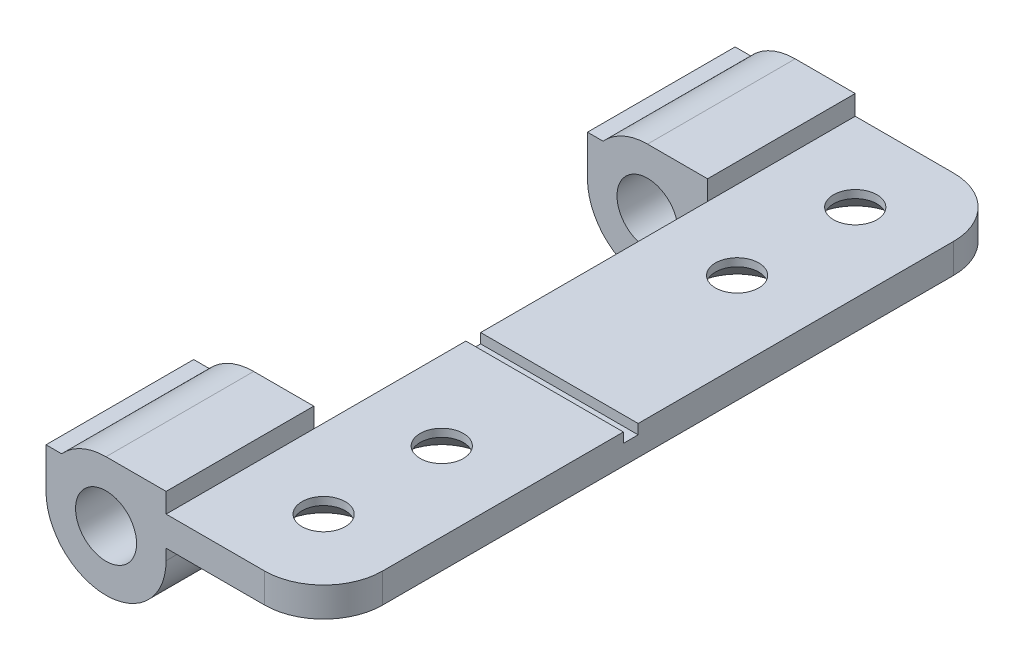
ISO-10303-21;
HEADER;
FILE_DESCRIPTION(('STEP AP214'),'2;1');
FILE_NAME('part.step','',(''),(''),'','','');
FILE_SCHEMA(('AUTOMOTIVE_DESIGN { 1 0 10303 214 1 1 1 1 }'));
ENDSEC;
DATA;
#1=APPLICATION_CONTEXT('core data for automotive mechanical design processes');
#2=APPLICATION_PROTOCOL_DEFINITION('international standard','automotive_design',2000,#1);
#3=PRODUCT_CONTEXT('',#1,'mechanical');
#4=PRODUCT('Part','Part','',(#3));
#5=PRODUCT_RELATED_PRODUCT_CATEGORY('part','',(#4));
#6=PRODUCT_DEFINITION_FORMATION('','',#4);
#7=PRODUCT_DEFINITION_CONTEXT('part definition',#1,'design');
#8=PRODUCT_DEFINITION('design','',#6,#7);
#9=PRODUCT_DEFINITION_SHAPE('','',#8);
#10=(LENGTH_UNIT() NAMED_UNIT(*) SI_UNIT(.MILLI.,.METRE.));
#11=(NAMED_UNIT(*) PLANE_ANGLE_UNIT() SI_UNIT($,.RADIAN.));
#12=(NAMED_UNIT(*) SI_UNIT($,.STERADIAN.) SOLID_ANGLE_UNIT());
#13=UNCERTAINTY_MEASURE_WITH_UNIT(LENGTH_MEASURE(1.E-05),#10,'distance_accuracy_value','');
#14=(GEOMETRIC_REPRESENTATION_CONTEXT(3) GLOBAL_UNCERTAINTY_ASSIGNED_CONTEXT((#13)) GLOBAL_UNIT_ASSIGNED_CONTEXT((#10,
#11,#12)) REPRESENTATION_CONTEXT('',''));
#15=CARTESIAN_POINT('',(0.,0.,0.));
#16=DIRECTION('',(0.,0.,1.));
#17=DIRECTION('',(1.,0.,0.));
#18=AXIS2_PLACEMENT_3D('',#15,#16,#17);
#19=CARTESIAN_POINT('',(3.05,2.05,7.5));
#20=DIRECTION('',(0.,-1.,0.));
#21=DIRECTION('',(0.,0.,-1.));
#22=AXIS2_PLACEMENT_3D('',#19,#20,#21);
#23=PLANE('',#22);
#24=CARTESIAN_POINT('',(7.05,2.05,31.));
#25=DIRECTION('',(0.,-1.,0.));
#26=DIRECTION('',(0.,0.,-1.));
#27=AXIS2_PLACEMENT_3D('',#24,#25,#26);
#28=CIRCLE('',#27,1.1);
#29=CARTESIAN_POINT('',(7.05,2.05,29.9));
#30=VERTEX_POINT('',#29);
#31=EDGE_CURVE('E234',#30,#30,#28,.T.);
#32=ORIENTED_EDGE('',*,*,#31,.T.);
#33=EDGE_LOOP('',(#32));
#34=FACE_BOUND('',#33,.T.);
#35=CARTESIAN_POINT('',(7.05,2.05,25.));
#36=DIRECTION('',(0.,-1.,0.));
#37=DIRECTION('',(0.,0.,-1.));
#38=AXIS2_PLACEMENT_3D('',#35,#36,#37);
#39=CIRCLE('',#38,1.1);
#40=CARTESIAN_POINT('',(7.05,2.05,23.9));
#41=VERTEX_POINT('',#40);
#42=EDGE_CURVE('E395',#41,#41,#39,.T.);
#43=ORIENTED_EDGE('',*,*,#42,.T.);
#44=EDGE_LOOP('',(#43));
#45=FACE_BOUND('',#44,.T.);
#46=DIRECTION('',(-1.,0.,0.));
#47=VECTOR('',#46,1.);
#48=CARTESIAN_POINT('',(11.05,2.05,35.));
#49=LINE('',#48,#47);
#50=CARTESIAN_POINT('',(8.05,2.05,35.));
#51=VERTEX_POINT('',#50);
#52=CARTESIAN_POINT('',(3.05,2.05,35.));
#53=VERTEX_POINT('',#52);
#54=EDGE_CURVE('E255',#51,#53,#49,.T.);
#55=ORIENTED_EDGE('',*,*,#54,.F.);
#56=CARTESIAN_POINT('',(8.05,2.05,32.));
#57=DIRECTION('',(0.,-1.,0.));
#58=DIRECTION('',(0.,0.,-1.));
#59=AXIS2_PLACEMENT_3D('',#56,#57,#58);
#60=CIRCLE('',#59,3.);
#61=CARTESIAN_POINT('',(11.05,2.05,32.));
#62=VERTEX_POINT('',#61);
#63=EDGE_CURVE('E11',#51,#62,#60,.F.);
#64=ORIENTED_EDGE('',*,*,#63,.T.);
#65=DIRECTION('',(0.,0.,-1.));
#66=VECTOR('',#65,1.);
#67=CARTESIAN_POINT('',(11.05,2.05,7.5));
#68=LINE('',#67,#66);
#69=CARTESIAN_POINT('',(11.05,2.05,19.775));
#70=VERTEX_POINT('',#69);
#71=EDGE_CURVE('E202',#62,#70,#68,.T.);
#72=ORIENTED_EDGE('',*,*,#71,.T.);
#73=DIRECTION('',(-1.,0.,0.));
#74=VECTOR('',#73,1.);
#75=CARTESIAN_POINT('',(11.05,2.05,19.775));
#76=LINE('',#75,#74);
#77=CARTESIAN_POINT('',(3.05,2.05,19.775));
#78=VERTEX_POINT('',#77);
#79=EDGE_CURVE('E205',#70,#78,#76,.T.);
#80=ORIENTED_EDGE('',*,*,#79,.T.);
#81=DIRECTION('',(0.,0.,-1.));
#82=VECTOR('',#81,1.);
#83=CARTESIAN_POINT('',(3.05,2.05,27.5));
#84=LINE('',#83,#82);
#85=CARTESIAN_POINT('',(3.05,2.05,27.5));
#86=VERTEX_POINT('',#85);
#87=EDGE_CURVE('E319',#86,#78,#84,.T.);
#88=ORIENTED_EDGE('',*,*,#87,.F.);
#89=DIRECTION('',(0.,0.,-1.));
#90=VECTOR('',#89,1.);
#91=CARTESIAN_POINT('',(3.05,2.05,35.));
#92=LINE('',#91,#90);
#93=EDGE_CURVE('E306',#53,#86,#92,.T.);
#94=ORIENTED_EDGE('',*,*,#93,.F.);
#95=EDGE_LOOP('',(#55,#64,#72,#80,#88,#94));
#96=FACE_BOUND('',#95,.T.);
#97=ADVANCED_FACE('F40',(#34,#45,#96),#23,.F.);
#98=CARTESIAN_POINT('',(0.,0.,7.5));
#99=DIRECTION('',(0.,0.,1.));
#100=DIRECTION('',(1.,0.,0.));
#101=AXIS2_PLACEMENT_3D('',#98,#99,#100);
#102=PLANE('',#101);
#103=DIRECTION('',(0.,-1.,0.));
#104=VECTOR('',#103,1.);
#105=CARTESIAN_POINT('',(3.05,2.05,7.5));
#106=LINE('',#105,#104);
#107=CARTESIAN_POINT('',(3.05,2.05,7.5));
#108=VERTEX_POINT('',#107);
#109=CARTESIAN_POINT('',(3.05,0.549999999999999,7.5));
#110=VERTEX_POINT('',#109);
#111=EDGE_CURVE('E309',#108,#110,#106,.T.);
#112=ORIENTED_EDGE('',*,*,#111,.F.);
#113=DIRECTION('',(0.,1.,0.));
#114=VECTOR('',#113,1.);
#115=CARTESIAN_POINT('',(3.05,2.05,7.5));
#116=LINE('',#115,#114);
#117=CARTESIAN_POINT('',(3.05,3.05,7.5));
#118=VERTEX_POINT('',#117);
#119=EDGE_CURVE('E328',#108,#118,#116,.T.);
#120=ORIENTED_EDGE('',*,*,#119,.T.);
#121=DIRECTION('',(-1.,0.,0.));
#122=VECTOR('',#121,1.);
#123=CARTESIAN_POINT('',(3.05,3.05,7.5));
#124=LINE('',#123,#122);
#125=CARTESIAN_POINT('',(0.,3.05,7.5));
#126=VERTEX_POINT('',#125);
#127=EDGE_CURVE('E331',#118,#126,#124,.T.);
#128=ORIENTED_EDGE('',*,*,#127,.T.);
#129=CARTESIAN_POINT('',(0.,0.,7.5));
#130=DIRECTION('',(0.,0.,1.));
#131=DIRECTION('',(1.,0.,0.));
#132=AXIS2_PLACEMENT_3D('',#129,#130,#131);
#133=CIRCLE('',#132,3.05);
#134=CARTESIAN_POINT('',(-2.25831795812724,2.05,7.5));
#135=VERTEX_POINT('',#134);
#136=EDGE_CURVE('E334',#126,#135,#133,.T.);
#137=ORIENTED_EDGE('',*,*,#136,.T.);
#138=DIRECTION('',(-1.,0.,0.));
#139=VECTOR('',#138,1.);
#140=CARTESIAN_POINT('',(-3.05,2.05,7.5));
#141=LINE('',#140,#139);
#142=CARTESIAN_POINT('',(-3.05,2.05,7.5));
#143=VERTEX_POINT('',#142);
#144=EDGE_CURVE('E336',#135,#143,#141,.T.);
#145=ORIENTED_EDGE('',*,*,#144,.T.);
#146=DIRECTION('',(0.,-1.,0.));
#147=VECTOR('',#146,1.);
#148=CARTESIAN_POINT('',(-3.05,0.,7.5));
#149=LINE('',#148,#147);
#150=CARTESIAN_POINT('',(-3.05,0.,7.5));
#151=VERTEX_POINT('',#150);
#152=EDGE_CURVE('E338',#143,#151,#149,.T.);
#153=ORIENTED_EDGE('',*,*,#152,.T.);
#154=CARTESIAN_POINT('',(0.,0.,7.5));
#155=DIRECTION('',(0.,0.,1.));
#156=DIRECTION('',(1.,0.,0.));
#157=AXIS2_PLACEMENT_3D('',#154,#155,#156);
#158=CIRCLE('',#157,3.05);
#159=CARTESIAN_POINT('',(3.05,0.,7.5));
#160=VERTEX_POINT('',#159);
#161=EDGE_CURVE('E340',#151,#160,#158,.T.);
#162=ORIENTED_EDGE('',*,*,#161,.T.);
#163=DIRECTION('',(0.,1.,0.));
#164=VECTOR('',#163,1.);
#165=CARTESIAN_POINT('',(3.05,0.,7.5));
#166=LINE('',#165,#164);
#167=EDGE_CURVE('E342',#160,#110,#166,.T.);
#168=ORIENTED_EDGE('',*,*,#167,.T.);
#169=EDGE_LOOP('',(#112,#120,#128,#137,#145,#153,#162,#168));
#170=FACE_BOUND('',#169,.T.);
#171=CARTESIAN_POINT('',(0.,0.,7.5));
#172=DIRECTION('',(0.,0.,1.));
#173=DIRECTION('',(1.,0.,0.));
#174=AXIS2_PLACEMENT_3D('',#171,#172,#173);
#175=CIRCLE('',#174,1.55);
#176=CARTESIAN_POINT('',(1.55,0.,7.5));
#177=VERTEX_POINT('',#176);
#178=EDGE_CURVE('E322',#177,#177,#175,.T.);
#179=ORIENTED_EDGE('',*,*,#178,.F.);
#180=EDGE_LOOP('',(#179));
#181=FACE_BOUND('',#180,.T.);
#182=ADVANCED_FACE('F488',(#170,#181),#102,.T.);
#183=CARTESIAN_POINT('',(0.,0.,0.));
#184=DIRECTION('',(0.,0.,1.));
#185=DIRECTION('',(1.,0.,0.));
#186=AXIS2_PLACEMENT_3D('',#183,#184,#185);
#187=PLANE('',#186);
#188=DIRECTION('',(-1.,0.,0.));
#189=VECTOR('',#188,1.);
#190=CARTESIAN_POINT('',(3.05,2.05,0.));
#191=LINE('',#190,#189);
#192=CARTESIAN_POINT('',(8.05,2.05,0.));
#193=VERTEX_POINT('',#192);
#194=CARTESIAN_POINT('',(3.05,2.05,0.));
#195=VERTEX_POINT('',#194);
#196=EDGE_CURVE('E332',#193,#195,#191,.T.);
#197=ORIENTED_EDGE('',*,*,#196,.F.);
#198=DIRECTION('',(0.,1.,0.));
#199=VECTOR('',#198,1.);
#200=CARTESIAN_POINT('',(8.05,0.,0.));
#201=LINE('',#200,#199);
#202=CARTESIAN_POINT('',(8.05,0.549999999999999,0.));
#203=VERTEX_POINT('',#202);
#204=EDGE_CURVE('E426',#193,#203,#201,.F.);
#205=ORIENTED_EDGE('',*,*,#204,.T.);
#206=DIRECTION('',(1.,0.,0.));
#207=VECTOR('',#206,1.);
#208=CARTESIAN_POINT('',(11.05,0.55,0.));
#209=LINE('',#208,#207);
#210=CARTESIAN_POINT('',(3.05,0.549999999999999,0.));
#211=VERTEX_POINT('',#210);
#212=EDGE_CURVE('E360',#211,#203,#209,.T.);
#213=ORIENTED_EDGE('',*,*,#212,.F.);
#214=DIRECTION('',(0.,1.,0.));
#215=VECTOR('',#214,1.);
#216=CARTESIAN_POINT('',(3.05,0.,0.));
#217=LINE('',#216,#215);
#218=CARTESIAN_POINT('',(3.05,0.,0.));
#219=VERTEX_POINT('',#218);
#220=EDGE_CURVE('E358',#219,#211,#217,.T.);
#221=ORIENTED_EDGE('',*,*,#220,.F.);
#222=CARTESIAN_POINT('',(0.,0.,0.));
#223=DIRECTION('',(0.,0.,1.));
#224=DIRECTION('',(1.,0.,0.));
#225=AXIS2_PLACEMENT_3D('',#222,#223,#224);
#226=CIRCLE('',#225,3.05);
#227=CARTESIAN_POINT('',(-3.05,0.,0.));
#228=VERTEX_POINT('',#227);
#229=EDGE_CURVE('E356',#228,#219,#226,.T.);
#230=ORIENTED_EDGE('',*,*,#229,.F.);
#231=DIRECTION('',(0.,-1.,0.));
#232=VECTOR('',#231,1.);
#233=CARTESIAN_POINT('',(-3.05,0.,0.));
#234=LINE('',#233,#232);
#235=CARTESIAN_POINT('',(-3.05,2.05,0.));
#236=VERTEX_POINT('',#235);
#237=EDGE_CURVE('E354',#236,#228,#234,.T.);
#238=ORIENTED_EDGE('',*,*,#237,.F.);
#239=DIRECTION('',(-1.,0.,0.));
#240=VECTOR('',#239,1.);
#241=CARTESIAN_POINT('',(-3.05,2.05,0.));
#242=LINE('',#241,#240);
#243=CARTESIAN_POINT('',(-2.25831795812724,2.05,0.));
#244=VERTEX_POINT('',#243);
#245=EDGE_CURVE('E352',#244,#236,#242,.T.);
#246=ORIENTED_EDGE('',*,*,#245,.F.);
#247=CARTESIAN_POINT('',(0.,0.,0.));
#248=DIRECTION('',(0.,0.,1.));
#249=DIRECTION('',(1.,0.,0.));
#250=AXIS2_PLACEMENT_3D('',#247,#248,#249);
#251=CIRCLE('',#250,3.05);
#252=CARTESIAN_POINT('',(0.,3.05,0.));
#253=VERTEX_POINT('',#252);
#254=EDGE_CURVE('E350',#253,#244,#251,.T.);
#255=ORIENTED_EDGE('',*,*,#254,.F.);
#256=DIRECTION('',(-1.,0.,0.));
#257=VECTOR('',#256,1.);
#258=CARTESIAN_POINT('',(3.05,3.05,0.));
#259=LINE('',#258,#257);
#260=CARTESIAN_POINT('',(3.05,3.05,0.));
#261=VERTEX_POINT('',#260);
#262=EDGE_CURVE('E348',#261,#253,#259,.T.);
#263=ORIENTED_EDGE('',*,*,#262,.F.);
#264=DIRECTION('',(0.,1.,0.));
#265=VECTOR('',#264,1.);
#266=CARTESIAN_POINT('',(3.05,2.05,0.));
#267=LINE('',#266,#265);
#268=EDGE_CURVE('E325',#195,#261,#267,.T.);
#269=ORIENTED_EDGE('',*,*,#268,.F.);
#270=EDGE_LOOP('',(#197,#205,#213,#221,#230,#238,#246,#255,#263,#269));
#271=FACE_BOUND('',#270,.T.);
#272=CARTESIAN_POINT('',(0.,0.,0.));
#273=DIRECTION('',(0.,0.,1.));
#274=DIRECTION('',(1.,0.,0.));
#275=AXIS2_PLACEMENT_3D('',#272,#273,#274);
#276=CIRCLE('',#275,1.55);
#277=CARTESIAN_POINT('',(1.55,0.,0.));
#278=VERTEX_POINT('',#277);
#279=EDGE_CURVE('E321',#278,#278,#276,.T.);
#280=ORIENTED_EDGE('',*,*,#279,.T.);
#281=EDGE_LOOP('',(#280));
#282=FACE_BOUND('',#281,.T.);
#283=ADVANCED_FACE('F494',(#271,#282),#187,.F.);
#284=CARTESIAN_POINT('',(3.05,2.05,7.5));
#285=DIRECTION('',(-1.,0.,0.));
#286=DIRECTION('',(0.,-1.,0.));
#287=AXIS2_PLACEMENT_3D('',#284,#285,#286);
#288=PLANE('',#287);
#289=ORIENTED_EDGE('',*,*,#268,.T.);
#290=DIRECTION('',(0.,0.,-1.));
#291=VECTOR('',#290,1.);
#292=CARTESIAN_POINT('',(3.05,3.05,7.5));
#293=LINE('',#292,#291);
#294=EDGE_CURVE('E385',#118,#261,#293,.T.);
#295=ORIENTED_EDGE('',*,*,#294,.F.);
#296=ORIENTED_EDGE('',*,*,#119,.F.);
#297=DIRECTION('',(0.,0.,-1.));
#298=VECTOR('',#297,1.);
#299=CARTESIAN_POINT('',(3.05,2.05,7.5));
#300=LINE('',#299,#298);
#301=EDGE_CURVE('E345',#108,#195,#300,.T.);
#302=ORIENTED_EDGE('',*,*,#301,.T.);
#303=EDGE_LOOP('',(#289,#295,#296,#302));
#304=FACE_BOUND('',#303,.T.);
#305=ADVANCED_FACE('F529',(#304),#288,.F.);
#306=CARTESIAN_POINT('',(3.05,3.05,7.5));
#307=DIRECTION('',(0.,-1.,0.));
#308=DIRECTION('',(1.,0.,0.));
#309=AXIS2_PLACEMENT_3D('',#306,#307,#308);
#310=PLANE('',#309);
#311=ORIENTED_EDGE('',*,*,#262,.T.);
#312=DIRECTION('',(0.,0.,-1.));
#313=VECTOR('',#312,1.);
#314=CARTESIAN_POINT('',(0.,3.05,7.5));
#315=LINE('',#314,#313);
#316=EDGE_CURVE('E382',#126,#253,#315,.T.);
#317=ORIENTED_EDGE('',*,*,#316,.F.);
#318=ORIENTED_EDGE('',*,*,#127,.F.);
#319=ORIENTED_EDGE('',*,*,#294,.T.);
#320=EDGE_LOOP('',(#311,#317,#318,#319));
#321=FACE_BOUND('',#320,.T.);
#322=ADVANCED_FACE('F557',(#321),#310,.F.);
#323=CARTESIAN_POINT('',(0.,0.,7.5));
#324=DIRECTION('',(0.,0.,-1.));
#325=DIRECTION('',(-1.,0.,0.));
#326=AXIS2_PLACEMENT_3D('',#323,#324,#325);
#327=CYLINDRICAL_SURFACE('',#326,3.05);
#328=ORIENTED_EDGE('',*,*,#254,.T.);
#329=DIRECTION('',(0.,0.,-1.));
#330=VECTOR('',#329,1.);
#331=CARTESIAN_POINT('',(-2.25831795812724,2.05,7.5));
#332=LINE('',#331,#330);
#333=EDGE_CURVE('E379',#135,#244,#332,.T.);
#334=ORIENTED_EDGE('',*,*,#333,.F.);
#335=ORIENTED_EDGE('',*,*,#136,.F.);
#336=ORIENTED_EDGE('',*,*,#316,.T.);
#337=EDGE_LOOP('',(#328,#334,#335,#336));
#338=FACE_BOUND('',#337,.T.);
#339=ADVANCED_FACE('F554',(#338),#327,.T.);
#340=CARTESIAN_POINT('',(-3.05,2.05,7.5));
#341=DIRECTION('',(0.,-1.,0.));
#342=DIRECTION('',(0.,0.,-1.));
#343=AXIS2_PLACEMENT_3D('',#340,#341,#342);
#344=PLANE('',#343);
#345=ORIENTED_EDGE('',*,*,#245,.T.);
#346=DIRECTION('',(0.,0.,-1.));
#347=VECTOR('',#346,1.);
#348=CARTESIAN_POINT('',(-3.05,2.05,7.5));
#349=LINE('',#348,#347);
#350=EDGE_CURVE('E376',#143,#236,#349,.T.);
#351=ORIENTED_EDGE('',*,*,#350,.F.);
#352=ORIENTED_EDGE('',*,*,#144,.F.);
#353=ORIENTED_EDGE('',*,*,#333,.T.);
#354=EDGE_LOOP('',(#345,#351,#352,#353));
#355=FACE_BOUND('',#354,.T.);
#356=ADVANCED_FACE('F550',(#355),#344,.F.);
#357=CARTESIAN_POINT('',(-3.05,0.,7.5));
#358=DIRECTION('',(1.,0.,0.));
#359=DIRECTION('',(0.,1.,0.));
#360=AXIS2_PLACEMENT_3D('',#357,#358,#359);
#361=PLANE('',#360);
#362=ORIENTED_EDGE('',*,*,#237,.T.);
#363=DIRECTION('',(0.,0.,-1.));
#364=VECTOR('',#363,1.);
#365=CARTESIAN_POINT('',(-3.05,0.,7.5));
#366=LINE('',#365,#364);
#367=EDGE_CURVE('E373',#151,#228,#366,.T.);
#368=ORIENTED_EDGE('',*,*,#367,.F.);
#369=ORIENTED_EDGE('',*,*,#152,.F.);
#370=ORIENTED_EDGE('',*,*,#350,.T.);
#371=EDGE_LOOP('',(#362,#368,#369,#370));
#372=FACE_BOUND('',#371,.T.);
#373=ADVANCED_FACE('F546',(#372),#361,.F.);
#374=CARTESIAN_POINT('',(0.,0.,7.5));
#375=DIRECTION('',(0.,0.,-1.));
#376=DIRECTION('',(-1.,0.,0.));
#377=AXIS2_PLACEMENT_3D('',#374,#375,#376);
#378=CYLINDRICAL_SURFACE('',#377,3.05);
#379=ORIENTED_EDGE('',*,*,#229,.T.);
#380=DIRECTION('',(0.,0.,-1.));
#381=VECTOR('',#380,1.);
#382=CARTESIAN_POINT('',(3.05,0.,7.5));
#383=LINE('',#382,#381);
#384=EDGE_CURVE('E370',#160,#219,#383,.T.);
#385=ORIENTED_EDGE('',*,*,#384,.F.);
#386=ORIENTED_EDGE('',*,*,#161,.F.);
#387=ORIENTED_EDGE('',*,*,#367,.T.);
#388=EDGE_LOOP('',(#379,#385,#386,#387));
#389=FACE_BOUND('',#388,.T.);
#390=ADVANCED_FACE('F483',(#389),#378,.T.);
#391=CARTESIAN_POINT('',(3.05,0.,7.5));
#392=DIRECTION('',(-1.,0.,0.));
#393=DIRECTION('',(0.,-1.,0.));
#394=AXIS2_PLACEMENT_3D('',#391,#392,#393);
#395=PLANE('',#394);
#396=ORIENTED_EDGE('',*,*,#220,.T.);
#397=DIRECTION('',(0.,0.,-1.));
#398=VECTOR('',#397,1.);
#399=CARTESIAN_POINT('',(3.05,0.549999999999999,7.5));
#400=LINE('',#399,#398);
#401=EDGE_CURVE('E367',#110,#211,#400,.T.);
#402=ORIENTED_EDGE('',*,*,#401,.F.);
#403=ORIENTED_EDGE('',*,*,#167,.F.);
#404=ORIENTED_EDGE('',*,*,#384,.T.);
#405=EDGE_LOOP('',(#396,#402,#403,#404));
#406=FACE_BOUND('',#405,.T.);
#407=ADVANCED_FACE('F474',(#406),#395,.F.);
#408=CARTESIAN_POINT('',(11.05,0.55,7.5));
#409=DIRECTION('',(0.,1.,0.));
#410=DIRECTION('',(-1.,0.,0.));
#411=AXIS2_PLACEMENT_3D('',#408,#409,#410);
#412=PLANE('',#411);
#413=CARTESIAN_POINT('',(7.05,0.549999999999999,31.));
#414=DIRECTION('',(0.,1.,0.));
#415=DIRECTION('',(-1.,0.,0.));
#416=AXIS2_PLACEMENT_3D('',#413,#414,#415);
#417=CIRCLE('',#416,2.20000000000001);
#418=CARTESIAN_POINT('',(4.85,0.549999999999999,31.));
#419=VERTEX_POINT('',#418);
#420=EDGE_CURVE('E407',#419,#419,#417,.T.);
#421=ORIENTED_EDGE('',*,*,#420,.T.);
#422=EDGE_LOOP('',(#421));
#423=FACE_BOUND('',#422,.T.);
#424=CARTESIAN_POINT('',(7.05,0.549999999999999,25.));
#425=DIRECTION('',(0.,1.,0.));
#426=DIRECTION('',(-1.,0.,0.));
#427=AXIS2_PLACEMENT_3D('',#424,#425,#426);
#428=CIRCLE('',#427,2.20000000000001);
#429=CARTESIAN_POINT('',(4.84999999999999,0.549999999999999,25.));
#430=VERTEX_POINT('',#429);
#431=EDGE_CURVE('E404',#430,#430,#428,.T.);
#432=ORIENTED_EDGE('',*,*,#431,.T.);
#433=EDGE_LOOP('',(#432));
#434=FACE_BOUND('',#433,.T.);
#435=CARTESIAN_POINT('',(7.05,0.549999999999999,10.));
#436=DIRECTION('',(0.,1.,0.));
#437=DIRECTION('',(-1.,0.,0.));
#438=AXIS2_PLACEMENT_3D('',#435,#436,#437);
#439=CIRCLE('',#438,2.20000000000001);
#440=CARTESIAN_POINT('',(4.84999999999999,0.549999999999999,10.));
#441=VERTEX_POINT('',#440);
#442=EDGE_CURVE('E401',#441,#441,#439,.T.);
#443=ORIENTED_EDGE('',*,*,#442,.T.);
#444=EDGE_LOOP('',(#443));
#445=FACE_BOUND('',#444,.T.);
#446=CARTESIAN_POINT('',(7.05,0.549999999999999,4.));
#447=DIRECTION('',(0.,1.,0.));
#448=DIRECTION('',(-1.,0.,0.));
#449=AXIS2_PLACEMENT_3D('',#446,#447,#448);
#450=CIRCLE('',#449,2.20000000000001);
#451=CARTESIAN_POINT('',(4.84999999999999,0.549999999999999,4.));
#452=VERTEX_POINT('',#451);
#453=EDGE_CURVE('E398',#452,#452,#450,.T.);
#454=ORIENTED_EDGE('',*,*,#453,.T.);
#455=EDGE_LOOP('',(#454));
#456=FACE_BOUND('',#455,.T.);
#457=ORIENTED_EDGE('',*,*,#212,.T.);
#458=CARTESIAN_POINT('',(8.05,0.549999999999999,3.));
#459=DIRECTION('',(0.,1.,0.));
#460=DIRECTION('',(-1.,0.,0.));
#461=AXIS2_PLACEMENT_3D('',#458,#459,#460);
#462=CIRCLE('',#461,3.);
#463=CARTESIAN_POINT('',(11.05,0.55,3.));
#464=VERTEX_POINT('',#463);
#465=EDGE_CURVE('E429',#203,#464,#462,.F.);
#466=ORIENTED_EDGE('',*,*,#465,.T.);
#467=DIRECTION('',(0.,0.,-1.));
#468=VECTOR('',#467,1.);
#469=CARTESIAN_POINT('',(11.05,0.55,7.5));
#470=LINE('',#469,#468);
#471=CARTESIAN_POINT('',(11.05,0.55,32.));
#472=VERTEX_POINT('',#471);
#473=EDGE_CURVE('E209',#472,#464,#470,.T.);
#474=ORIENTED_EDGE('',*,*,#473,.F.);
#475=CARTESIAN_POINT('',(8.05,0.549999999999999,32.));
#476=DIRECTION('',(0.,1.,0.));
#477=DIRECTION('',(-1.,0.,0.));
#478=AXIS2_PLACEMENT_3D('',#475,#476,#477);
#479=CIRCLE('',#478,3.);
#480=CARTESIAN_POINT('',(8.05,0.549999999999999,35.));
#481=VERTEX_POINT('',#480);
#482=EDGE_CURVE('E61',#472,#481,#479,.F.);
#483=ORIENTED_EDGE('',*,*,#482,.T.);
#484=DIRECTION('',(1.,0.,0.));
#485=VECTOR('',#484,1.);
#486=CARTESIAN_POINT('',(3.05,0.549999999999999,35.));
#487=LINE('',#486,#485);
#488=CARTESIAN_POINT('',(3.05,0.549999999999999,35.));
#489=VERTEX_POINT('',#488);
#490=EDGE_CURVE('E253',#489,#481,#487,.T.);
#491=ORIENTED_EDGE('',*,*,#490,.F.);
#492=DIRECTION('',(0.,0.,-1.));
#493=VECTOR('',#492,1.);
#494=CARTESIAN_POINT('',(3.05,0.549999999999999,35.));
#495=LINE('',#494,#493);
#496=CARTESIAN_POINT('',(3.05,0.549999999999999,27.5));
#497=VERTEX_POINT('',#496);
#498=EDGE_CURVE('E272',#489,#497,#495,.T.);
#499=ORIENTED_EDGE('',*,*,#498,.T.);
#500=DIRECTION('',(0.,0.,-1.));
#501=VECTOR('',#500,1.);
#502=CARTESIAN_POINT('',(3.05,0.549999999999999,27.5));
#503=LINE('',#502,#501);
#504=EDGE_CURVE('E313',#497,#110,#503,.T.);
#505=ORIENTED_EDGE('',*,*,#504,.T.);
#506=ORIENTED_EDGE('',*,*,#401,.T.);
#507=EDGE_LOOP('',(#457,#466,#474,#483,#491,#499,#505,#506));
#508=FACE_BOUND('',#507,.T.);
#509=ADVANCED_FACE('F470',(#423,#434,#445,#456,#508),#412,.F.);
#510=CARTESIAN_POINT('',(11.05,2.05,7.5));
#511=DIRECTION('',(-1.,0.,0.));
#512=DIRECTION('',(0.,0.,1.));
#513=AXIS2_PLACEMENT_3D('',#510,#511,#512);
#514=PLANE('',#513);
#515=ORIENTED_EDGE('',*,*,#473,.T.);
#516=DIRECTION('',(0.,1.,0.));
#517=VECTOR('',#516,1.);
#518=CARTESIAN_POINT('',(11.05,2.05,3.));
#519=LINE('',#518,#517);
#520=CARTESIAN_POINT('',(11.05,2.05,3.));
#521=VERTEX_POINT('',#520);
#522=EDGE_CURVE('E421',#464,#521,#519,.T.);
#523=ORIENTED_EDGE('',*,*,#522,.T.);
#524=CARTESIAN_POINT('',(11.05,2.05,19.025));
#525=VERTEX_POINT('',#524);
#526=EDGE_CURVE('E210',#525,#521,#68,.T.);
#527=ORIENTED_EDGE('',*,*,#526,.F.);
#528=DIRECTION('',(0.,-1.,0.));
#529=VECTOR('',#528,1.);
#530=CARTESIAN_POINT('',(11.05,2.05,19.025));
#531=LINE('',#530,#529);
#532=CARTESIAN_POINT('',(11.05,1.55,19.025));
#533=VERTEX_POINT('',#532);
#534=EDGE_CURVE('E226',#525,#533,#531,.T.);
#535=ORIENTED_EDGE('',*,*,#534,.T.);
#536=DIRECTION('',(0.,0.,1.));
#537=VECTOR('',#536,1.);
#538=CARTESIAN_POINT('',(11.05,1.55,19.775));
#539=LINE('',#538,#537);
#540=CARTESIAN_POINT('',(11.05,1.55,19.775));
#541=VERTEX_POINT('',#540);
#542=EDGE_CURVE('E220',#533,#541,#539,.T.);
#543=ORIENTED_EDGE('',*,*,#542,.T.);
#544=DIRECTION('',(0.,1.,0.));
#545=VECTOR('',#544,1.);
#546=CARTESIAN_POINT('',(11.05,2.05,19.775));
#547=LINE('',#546,#545);
#548=EDGE_CURVE('E215',#541,#70,#547,.T.);
#549=ORIENTED_EDGE('',*,*,#548,.T.);
#550=ORIENTED_EDGE('',*,*,#71,.F.);
#551=DIRECTION('',(0.,1.,0.));
#552=VECTOR('',#551,1.);
#553=CARTESIAN_POINT('',(11.05,0.55,32.));
#554=LINE('',#553,#552);
#555=EDGE_CURVE('E419',#62,#472,#554,.F.);
#556=ORIENTED_EDGE('',*,*,#555,.T.);
#557=EDGE_LOOP('',(#515,#523,#527,#535,#543,#549,#550,#556));
#558=FACE_BOUND('',#557,.T.);
#559=ADVANCED_FACE('F223',(#558),#514,.F.);
#560=CARTESIAN_POINT('',(7.05,2.05,4.));
#561=DIRECTION('',(0.,-1.,0.));
#562=DIRECTION('',(0.,0.,-1.));
#563=AXIS2_PLACEMENT_3D('',#560,#561,#562);
#564=CIRCLE('',#563,1.1);
#565=CARTESIAN_POINT('',(7.05,2.05,2.9));
#566=VERTEX_POINT('',#565);
#567=EDGE_CURVE('E392',#566,#566,#564,.T.);
#568=ORIENTED_EDGE('',*,*,#567,.T.);
#569=EDGE_LOOP('',(#568));
#570=FACE_BOUND('',#569,.T.);
#571=CARTESIAN_POINT('',(7.05,2.05,10.));
#572=DIRECTION('',(0.,-1.,0.));
#573=DIRECTION('',(0.,0.,-1.));
#574=AXIS2_PLACEMENT_3D('',#571,#572,#573);
#575=CIRCLE('',#574,1.1);
#576=CARTESIAN_POINT('',(7.05,2.05,8.9));
#577=VERTEX_POINT('',#576);
#578=EDGE_CURVE('E389',#577,#577,#575,.T.);
#579=ORIENTED_EDGE('',*,*,#578,.T.);
#580=EDGE_LOOP('',(#579));
#581=FACE_BOUND('',#580,.T.);
#582=ORIENTED_EDGE('',*,*,#526,.T.);
#583=CARTESIAN_POINT('',(8.05,2.05,3.));
#584=DIRECTION('',(0.,-1.,0.));
#585=DIRECTION('',(0.,0.,-1.));
#586=AXIS2_PLACEMENT_3D('',#583,#584,#585);
#587=CIRCLE('',#586,3.);
#588=EDGE_CURVE('E424',#521,#193,#587,.F.);
#589=ORIENTED_EDGE('',*,*,#588,.T.);
#590=ORIENTED_EDGE('',*,*,#196,.T.);
#591=ORIENTED_EDGE('',*,*,#301,.F.);
#592=CARTESIAN_POINT('',(3.05,2.05,19.025));
#593=VERTEX_POINT('',#592);
#594=EDGE_CURVE('E318',#593,#108,#84,.T.);
#595=ORIENTED_EDGE('',*,*,#594,.F.);
#596=DIRECTION('',(-1.,0.,0.));
#597=VECTOR('',#596,1.);
#598=CARTESIAN_POINT('',(11.05,2.05,19.025));
#599=LINE('',#598,#597);
#600=EDGE_CURVE('E219',#525,#593,#599,.T.);
#601=ORIENTED_EDGE('',*,*,#600,.F.);
#602=EDGE_LOOP('',(#582,#589,#590,#591,#595,#601));
#603=FACE_BOUND('',#602,.T.);
#604=ADVANCED_FACE('F481',(#570,#581,#603),#23,.F.);
#605=CARTESIAN_POINT('',(0.,0.,7.5));
#606=DIRECTION('',(0.,0.,-1.));
#607=DIRECTION('',(-1.,0.,0.));
#608=AXIS2_PLACEMENT_3D('',#605,#606,#607);
#609=CYLINDRICAL_SURFACE('',#608,1.55);
#610=ORIENTED_EDGE('',*,*,#178,.T.);
#611=EDGE_LOOP('',(#610));
#612=FACE_BOUND('',#611,.T.);
#613=ORIENTED_EDGE('',*,*,#279,.F.);
#614=EDGE_LOOP('',(#613));
#615=FACE_BOUND('',#614,.T.);
#616=ADVANCED_FACE('F501',(#612,#615),#609,.F.);
#617=CARTESIAN_POINT('',(3.05,2.05,27.5));
#618=DIRECTION('',(1.,0.,0.));
#619=DIRECTION('',(0.,0.,-1.));
#620=AXIS2_PLACEMENT_3D('',#617,#618,#619);
#621=PLANE('',#620);
#622=ORIENTED_EDGE('',*,*,#87,.T.);
#623=DIRECTION('',(0.,1.,0.));
#624=VECTOR('',#623,1.);
#625=CARTESIAN_POINT('',(3.05,2.05,19.775));
#626=LINE('',#625,#624);
#627=CARTESIAN_POINT('',(3.05,1.55,19.775));
#628=VERTEX_POINT('',#627);
#629=EDGE_CURVE('E218',#628,#78,#626,.T.);
#630=ORIENTED_EDGE('',*,*,#629,.F.);
#631=DIRECTION('',(0.,0.,1.));
#632=VECTOR('',#631,1.);
#633=CARTESIAN_POINT('',(3.05,1.55,19.775));
#634=LINE('',#633,#632);
#635=CARTESIAN_POINT('',(3.05,1.55,19.025));
#636=VERTEX_POINT('',#635);
#637=EDGE_CURVE('E227',#636,#628,#634,.T.);
#638=ORIENTED_EDGE('',*,*,#637,.F.);
#639=DIRECTION('',(0.,-1.,0.));
#640=VECTOR('',#639,1.);
#641=CARTESIAN_POINT('',(3.05,2.05,19.025));
#642=LINE('',#641,#640);
#643=EDGE_CURVE('E231',#593,#636,#642,.T.);
#644=ORIENTED_EDGE('',*,*,#643,.F.);
#645=ORIENTED_EDGE('',*,*,#594,.T.);
#646=ORIENTED_EDGE('',*,*,#111,.T.);
#647=ORIENTED_EDGE('',*,*,#504,.F.);
#648=DIRECTION('',(0.,-1.,0.));
#649=VECTOR('',#648,1.);
#650=CARTESIAN_POINT('',(3.05,2.05,27.5));
#651=LINE('',#650,#649);
#652=EDGE_CURVE('E310',#86,#497,#651,.T.);
#653=ORIENTED_EDGE('',*,*,#652,.F.);
#654=EDGE_LOOP('',(#622,#630,#638,#644,#645,#646,#647,#653));
#655=FACE_BOUND('',#654,.T.);
#656=ADVANCED_FACE('F506',(#655),#621,.F.);
#657=CARTESIAN_POINT('',(0.,0.,27.5));
#658=DIRECTION('',(0.,0.,1.));
#659=DIRECTION('',(1.,0.,0.));
#660=AXIS2_PLACEMENT_3D('',#657,#658,#659);
#661=PLANE('',#660);
#662=CARTESIAN_POINT('',(0.,0.,27.5));
#663=DIRECTION('',(0.,0.,1.));
#664=DIRECTION('',(1.,0.,0.));
#665=AXIS2_PLACEMENT_3D('',#662,#663,#664);
#666=CIRCLE('',#665,1.55);
#667=CARTESIAN_POINT('',(1.55,0.,27.5));
#668=VERTEX_POINT('',#667);
#669=EDGE_CURVE('E243',#668,#668,#666,.T.);
#670=ORIENTED_EDGE('',*,*,#669,.T.);
#671=EDGE_LOOP('',(#670));
#672=FACE_BOUND('',#671,.T.);
#673=DIRECTION('',(0.,1.,0.));
#674=VECTOR('',#673,1.);
#675=CARTESIAN_POINT('',(3.05,2.05,27.5));
#676=LINE('',#675,#674);
#677=CARTESIAN_POINT('',(3.05,3.05,27.5));
#678=VERTEX_POINT('',#677);
#679=EDGE_CURVE('E250',#86,#678,#676,.T.);
#680=ORIENTED_EDGE('',*,*,#679,.F.);
#681=ORIENTED_EDGE('',*,*,#652,.T.);
#682=DIRECTION('',(0.,1.,0.));
#683=VECTOR('',#682,1.);
#684=CARTESIAN_POINT('',(3.05,0.,27.5));
#685=LINE('',#684,#683);
#686=CARTESIAN_POINT('',(3.05,0.,27.5));
#687=VERTEX_POINT('',#686);
#688=EDGE_CURVE('E256',#687,#497,#685,.T.);
#689=ORIENTED_EDGE('',*,*,#688,.F.);
#690=CARTESIAN_POINT('',(0.,0.,27.5));
#691=DIRECTION('',(0.,0.,1.));
#692=DIRECTION('',(1.,0.,0.));
#693=AXIS2_PLACEMENT_3D('',#690,#691,#692);
#694=CIRCLE('',#693,3.05);
#695=CARTESIAN_POINT('',(-3.05,0.,27.5));
#696=VERTEX_POINT('',#695);
#697=EDGE_CURVE('E282',#696,#687,#694,.T.);
#698=ORIENTED_EDGE('',*,*,#697,.F.);
#699=DIRECTION('',(0.,-1.,0.));
#700=VECTOR('',#699,1.);
#701=CARTESIAN_POINT('',(-3.05,2.05,27.5));
#702=LINE('',#701,#700);
#703=CARTESIAN_POINT('',(-3.05,2.05,27.5));
#704=VERTEX_POINT('',#703);
#705=EDGE_CURVE('E280',#704,#696,#702,.T.);
#706=ORIENTED_EDGE('',*,*,#705,.F.);
#707=DIRECTION('',(-1.,0.,0.));
#708=VECTOR('',#707,1.);
#709=CARTESIAN_POINT('',(-2.25831795812724,2.05,27.5));
#710=LINE('',#709,#708);
#711=CARTESIAN_POINT('',(-2.25831795812724,2.05,27.5));
#712=VERTEX_POINT('',#711);
#713=EDGE_CURVE('E278',#712,#704,#710,.T.);
#714=ORIENTED_EDGE('',*,*,#713,.F.);
#715=CARTESIAN_POINT('',(0.,0.,27.5));
#716=DIRECTION('',(0.,0.,1.));
#717=DIRECTION('',(1.,0.,0.));
#718=AXIS2_PLACEMENT_3D('',#715,#716,#717);
#719=CIRCLE('',#718,3.05);
#720=CARTESIAN_POINT('',(0.,3.05,27.5));
#721=VERTEX_POINT('',#720);
#722=EDGE_CURVE('E276',#721,#712,#719,.T.);
#723=ORIENTED_EDGE('',*,*,#722,.F.);
#724=DIRECTION('',(-1.,0.,0.));
#725=VECTOR('',#724,1.);
#726=CARTESIAN_POINT('',(3.05,3.05,27.5));
#727=LINE('',#726,#725);
#728=EDGE_CURVE('E274',#678,#721,#727,.T.);
#729=ORIENTED_EDGE('',*,*,#728,.F.);
#730=EDGE_LOOP('',(#680,#681,#689,#698,#706,#714,#723,#729));
#731=FACE_BOUND('',#730,.T.);
#732=ADVANCED_FACE('F615',(#672,#731),#661,.F.);
#733=CARTESIAN_POINT('',(0.,0.,35.));
#734=DIRECTION('',(0.,0.,1.));
#735=DIRECTION('',(1.,0.,0.));
#736=AXIS2_PLACEMENT_3D('',#733,#734,#735);
#737=PLANE('',#736);
#738=ORIENTED_EDGE('',*,*,#490,.T.);
#739=DIRECTION('',(0.,1.,0.));
#740=VECTOR('',#739,1.);
#741=CARTESIAN_POINT('',(8.05,2.05,35.));
#742=LINE('',#741,#740);
#743=EDGE_CURVE('E48',#481,#51,#742,.T.);
#744=ORIENTED_EDGE('',*,*,#743,.T.);
#745=ORIENTED_EDGE('',*,*,#54,.T.);
#746=DIRECTION('',(0.,1.,0.));
#747=VECTOR('',#746,1.);
#748=CARTESIAN_POINT('',(3.05,2.05,35.));
#749=LINE('',#748,#747);
#750=CARTESIAN_POINT('',(3.05,3.05,35.));
#751=VERTEX_POINT('',#750);
#752=EDGE_CURVE('E258',#53,#751,#749,.T.);
#753=ORIENTED_EDGE('',*,*,#752,.T.);
#754=DIRECTION('',(-1.,0.,0.));
#755=VECTOR('',#754,1.);
#756=CARTESIAN_POINT('',(3.05,3.05,35.));
#757=LINE('',#756,#755);
#758=CARTESIAN_POINT('',(0.,3.05,35.));
#759=VERTEX_POINT('',#758);
#760=EDGE_CURVE('E260',#751,#759,#757,.T.);
#761=ORIENTED_EDGE('',*,*,#760,.T.);
#762=CARTESIAN_POINT('',(0.,0.,35.));
#763=DIRECTION('',(0.,0.,1.));
#764=DIRECTION('',(1.,0.,0.));
#765=AXIS2_PLACEMENT_3D('',#762,#763,#764);
#766=CIRCLE('',#765,3.05);
#767=CARTESIAN_POINT('',(-2.25831795812724,2.05,35.));
#768=VERTEX_POINT('',#767);
#769=EDGE_CURVE('E262',#759,#768,#766,.T.);
#770=ORIENTED_EDGE('',*,*,#769,.T.);
#771=DIRECTION('',(-1.,0.,0.));
#772=VECTOR('',#771,1.);
#773=CARTESIAN_POINT('',(-2.25831795812724,2.05,35.));
#774=LINE('',#773,#772);
#775=CARTESIAN_POINT('',(-3.05,2.05,35.));
#776=VERTEX_POINT('',#775);
#777=EDGE_CURVE('E264',#768,#776,#774,.T.);
#778=ORIENTED_EDGE('',*,*,#777,.T.);
#779=DIRECTION('',(0.,-1.,0.));
#780=VECTOR('',#779,1.);
#781=CARTESIAN_POINT('',(-3.05,2.05,35.));
#782=LINE('',#781,#780);
#783=CARTESIAN_POINT('',(-3.05,0.,35.));
#784=VERTEX_POINT('',#783);
#785=EDGE_CURVE('E266',#776,#784,#782,.T.);
#786=ORIENTED_EDGE('',*,*,#785,.T.);
#787=CARTESIAN_POINT('',(0.,0.,35.));
#788=DIRECTION('',(0.,0.,1.));
#789=DIRECTION('',(1.,0.,0.));
#790=AXIS2_PLACEMENT_3D('',#787,#788,#789);
#791=CIRCLE('',#790,3.05);
#792=CARTESIAN_POINT('',(3.05,0.,35.));
#793=VERTEX_POINT('',#792);
#794=EDGE_CURVE('E268',#784,#793,#791,.T.);
#795=ORIENTED_EDGE('',*,*,#794,.T.);
#796=DIRECTION('',(0.,1.,0.));
#797=VECTOR('',#796,1.);
#798=CARTESIAN_POINT('',(3.05,0.,35.));
#799=LINE('',#798,#797);
#800=EDGE_CURVE('E270',#793,#489,#799,.T.);
#801=ORIENTED_EDGE('',*,*,#800,.T.);
#802=EDGE_LOOP('',(#738,#744,#745,#753,#761,#770,#778,#786,#795,#801));
#803=FACE_BOUND('',#802,.T.);
#804=CARTESIAN_POINT('',(0.,0.,35.));
#805=DIRECTION('',(0.,0.,1.));
#806=DIRECTION('',(1.,0.,0.));
#807=AXIS2_PLACEMENT_3D('',#804,#805,#806);
#808=CIRCLE('',#807,1.55);
#809=CARTESIAN_POINT('',(1.55,0.,35.));
#810=VERTEX_POINT('',#809);
#811=EDGE_CURVE('E247',#810,#810,#808,.T.);
#812=ORIENTED_EDGE('',*,*,#811,.F.);
#813=EDGE_LOOP('',(#812));
#814=FACE_BOUND('',#813,.T.);
#815=ADVANCED_FACE('F431',(#803,#814),#737,.T.);
#816=CARTESIAN_POINT('',(3.05,2.05,35.));
#817=DIRECTION('',(-1.,0.,0.));
#818=DIRECTION('',(0.,-1.,0.));
#819=AXIS2_PLACEMENT_3D('',#816,#817,#818);
#820=PLANE('',#819);
#821=ORIENTED_EDGE('',*,*,#679,.T.);
#822=DIRECTION('',(0.,0.,-1.));
#823=VECTOR('',#822,1.);
#824=CARTESIAN_POINT('',(3.05,3.05,35.));
#825=LINE('',#824,#823);
#826=EDGE_CURVE('E303',#751,#678,#825,.T.);
#827=ORIENTED_EDGE('',*,*,#826,.F.);
#828=ORIENTED_EDGE('',*,*,#752,.F.);
#829=ORIENTED_EDGE('',*,*,#93,.T.);
#830=EDGE_LOOP('',(#821,#827,#828,#829));
#831=FACE_BOUND('',#830,.T.);
#832=ADVANCED_FACE('F439',(#831),#820,.F.);
#833=CARTESIAN_POINT('',(3.05,3.05,35.));
#834=DIRECTION('',(0.,-1.,0.));
#835=DIRECTION('',(1.,0.,0.));
#836=AXIS2_PLACEMENT_3D('',#833,#834,#835);
#837=PLANE('',#836);
#838=ORIENTED_EDGE('',*,*,#728,.T.);
#839=DIRECTION('',(0.,0.,-1.));
#840=VECTOR('',#839,1.);
#841=CARTESIAN_POINT('',(0.,3.05,35.));
#842=LINE('',#841,#840);
#843=EDGE_CURVE('E300',#759,#721,#842,.T.);
#844=ORIENTED_EDGE('',*,*,#843,.F.);
#845=ORIENTED_EDGE('',*,*,#760,.F.);
#846=ORIENTED_EDGE('',*,*,#826,.T.);
#847=EDGE_LOOP('',(#838,#844,#845,#846));
#848=FACE_BOUND('',#847,.T.);
#849=ADVANCED_FACE('F445',(#848),#837,.F.);
#850=CARTESIAN_POINT('',(0.,0.,35.));
#851=DIRECTION('',(0.,0.,-1.));
#852=DIRECTION('',(-1.,0.,0.));
#853=AXIS2_PLACEMENT_3D('',#850,#851,#852);
#854=CYLINDRICAL_SURFACE('',#853,3.05);
#855=ORIENTED_EDGE('',*,*,#722,.T.);
#856=DIRECTION('',(0.,0.,-1.));
#857=VECTOR('',#856,1.);
#858=CARTESIAN_POINT('',(-2.25831795812724,2.05,35.));
#859=LINE('',#858,#857);
#860=EDGE_CURVE('E297',#768,#712,#859,.T.);
#861=ORIENTED_EDGE('',*,*,#860,.F.);
#862=ORIENTED_EDGE('',*,*,#769,.F.);
#863=ORIENTED_EDGE('',*,*,#843,.T.);
#864=EDGE_LOOP('',(#855,#861,#862,#863));
#865=FACE_BOUND('',#864,.T.);
#866=ADVANCED_FACE('F449',(#865),#854,.T.);
#867=CARTESIAN_POINT('',(-2.25831795812724,2.05,35.));
#868=DIRECTION('',(0.,-1.,0.));
#869=DIRECTION('',(0.,0.,-1.));
#870=AXIS2_PLACEMENT_3D('',#867,#868,#869);
#871=PLANE('',#870);
#872=ORIENTED_EDGE('',*,*,#713,.T.);
#873=DIRECTION('',(0.,0.,-1.));
#874=VECTOR('',#873,1.);
#875=CARTESIAN_POINT('',(-3.05,2.05,35.));
#876=LINE('',#875,#874);
#877=EDGE_CURVE('E294',#776,#704,#876,.T.);
#878=ORIENTED_EDGE('',*,*,#877,.F.);
#879=ORIENTED_EDGE('',*,*,#777,.F.);
#880=ORIENTED_EDGE('',*,*,#860,.T.);
#881=EDGE_LOOP('',(#872,#878,#879,#880));
#882=FACE_BOUND('',#881,.T.);
#883=ADVANCED_FACE('F454',(#882),#871,.F.);
#884=CARTESIAN_POINT('',(-3.05,2.05,35.));
#885=DIRECTION('',(1.,0.,0.));
#886=DIRECTION('',(0.,1.,0.));
#887=AXIS2_PLACEMENT_3D('',#884,#885,#886);
#888=PLANE('',#887);
#889=ORIENTED_EDGE('',*,*,#705,.T.);
#890=DIRECTION('',(0.,0.,-1.));
#891=VECTOR('',#890,1.);
#892=CARTESIAN_POINT('',(-3.05,0.,35.));
#893=LINE('',#892,#891);
#894=EDGE_CURVE('E291',#784,#696,#893,.T.);
#895=ORIENTED_EDGE('',*,*,#894,.F.);
#896=ORIENTED_EDGE('',*,*,#785,.F.);
#897=ORIENTED_EDGE('',*,*,#877,.T.);
#898=EDGE_LOOP('',(#889,#895,#896,#897));
#899=FACE_BOUND('',#898,.T.);
#900=ADVANCED_FACE('F460',(#899),#888,.F.);
#901=CARTESIAN_POINT('',(0.,0.,35.));
#902=DIRECTION('',(0.,0.,-1.));
#903=DIRECTION('',(-1.,0.,0.));
#904=AXIS2_PLACEMENT_3D('',#901,#902,#903);
#905=CYLINDRICAL_SURFACE('',#904,3.05);
#906=ORIENTED_EDGE('',*,*,#697,.T.);
#907=DIRECTION('',(0.,0.,-1.));
#908=VECTOR('',#907,1.);
#909=CARTESIAN_POINT('',(3.05,0.,35.));
#910=LINE('',#909,#908);
#911=EDGE_CURVE('E288',#793,#687,#910,.T.);
#912=ORIENTED_EDGE('',*,*,#911,.F.);
#913=ORIENTED_EDGE('',*,*,#794,.F.);
#914=ORIENTED_EDGE('',*,*,#894,.T.);
#915=EDGE_LOOP('',(#906,#912,#913,#914));
#916=FACE_BOUND('',#915,.T.);
#917=ADVANCED_FACE('F464',(#916),#905,.T.);
#918=CARTESIAN_POINT('',(3.05,0.,35.));
#919=DIRECTION('',(-1.,0.,0.));
#920=DIRECTION('',(0.,-1.,0.));
#921=AXIS2_PLACEMENT_3D('',#918,#919,#920);
#922=PLANE('',#921);
#923=ORIENTED_EDGE('',*,*,#688,.T.);
#924=ORIENTED_EDGE('',*,*,#498,.F.);
#925=ORIENTED_EDGE('',*,*,#800,.F.);
#926=ORIENTED_EDGE('',*,*,#911,.T.);
#927=EDGE_LOOP('',(#923,#924,#925,#926));
#928=FACE_BOUND('',#927,.T.);
#929=ADVANCED_FACE('F469',(#928),#922,.F.);
#930=CARTESIAN_POINT('',(0.,0.,35.));
#931=DIRECTION('',(0.,0.,-1.));
#932=DIRECTION('',(-1.,0.,0.));
#933=AXIS2_PLACEMENT_3D('',#930,#931,#932);
#934=CYLINDRICAL_SURFACE('',#933,1.55);
#935=ORIENTED_EDGE('',*,*,#811,.T.);
#936=EDGE_LOOP('',(#935));
#937=FACE_BOUND('',#936,.T.);
#938=ORIENTED_EDGE('',*,*,#669,.F.);
#939=EDGE_LOOP('',(#938));
#940=FACE_BOUND('',#939,.T.);
#941=ADVANCED_FACE('F743',(#937,#940),#934,.F.);
#942=CARTESIAN_POINT('',(11.05,2.05,19.775));
#943=DIRECTION('',(0.,0.,1.));
#944=DIRECTION('',(1.,0.,0.));
#945=AXIS2_PLACEMENT_3D('',#942,#943,#944);
#946=PLANE('',#945);
#947=ORIENTED_EDGE('',*,*,#629,.T.);
#948=ORIENTED_EDGE('',*,*,#79,.F.);
#949=ORIENTED_EDGE('',*,*,#548,.F.);
#950=DIRECTION('',(-1.,0.,0.));
#951=VECTOR('',#950,1.);
#952=CARTESIAN_POINT('',(11.05,1.55,19.775));
#953=LINE('',#952,#951);
#954=EDGE_CURVE('E241',#541,#628,#953,.T.);
#955=ORIENTED_EDGE('',*,*,#954,.T.);
#956=EDGE_LOOP('',(#947,#948,#949,#955));
#957=FACE_BOUND('',#956,.T.);
#958=ADVANCED_FACE('F214',(#957),#946,.F.);
#959=CARTESIAN_POINT('',(11.05,1.55,19.775));
#960=DIRECTION('',(0.,-1.,0.));
#961=DIRECTION('',(0.,0.,-1.));
#962=AXIS2_PLACEMENT_3D('',#959,#960,#961);
#963=PLANE('',#962);
#964=ORIENTED_EDGE('',*,*,#637,.T.);
#965=ORIENTED_EDGE('',*,*,#954,.F.);
#966=ORIENTED_EDGE('',*,*,#542,.F.);
#967=DIRECTION('',(-1.,0.,0.));
#968=VECTOR('',#967,1.);
#969=CARTESIAN_POINT('',(11.05,1.55,19.025));
#970=LINE('',#969,#968);
#971=EDGE_CURVE('E244',#533,#636,#970,.T.);
#972=ORIENTED_EDGE('',*,*,#971,.T.);
#973=EDGE_LOOP('',(#964,#965,#966,#972));
#974=FACE_BOUND('',#973,.T.);
#975=ADVANCED_FACE('F725',(#974),#963,.F.);
#976=CARTESIAN_POINT('',(11.05,2.05,19.025));
#977=DIRECTION('',(0.,0.,-1.));
#978=DIRECTION('',(-1.,0.,0.));
#979=AXIS2_PLACEMENT_3D('',#976,#977,#978);
#980=PLANE('',#979);
#981=ORIENTED_EDGE('',*,*,#643,.T.);
#982=ORIENTED_EDGE('',*,*,#971,.F.);
#983=ORIENTED_EDGE('',*,*,#534,.F.);
#984=ORIENTED_EDGE('',*,*,#600,.T.);
#985=EDGE_LOOP('',(#981,#982,#983,#984));
#986=FACE_BOUND('',#985,.T.);
#987=ADVANCED_FACE('F715',(#986),#980,.F.);
#988=CARTESIAN_POINT('',(7.05,3.05,10.));
#989=DIRECTION('',(0.,-1.,0.));
#990=DIRECTION('',(1.,0.,0.));
#991=AXIS2_PLACEMENT_3D('',#988,#989,#990);
#992=CYLINDRICAL_SURFACE('',#991,1.1);
#993=CARTESIAN_POINT('',(7.05,1.65,10.));
#994=DIRECTION('',(0.,1.,0.));
#995=DIRECTION('',(0.,0.,1.));
#996=AXIS2_PLACEMENT_3D('',#993,#994,#995);
#997=CIRCLE('',#996,1.1);
#998=CARTESIAN_POINT('',(7.05,1.65,11.1));
#999=VERTEX_POINT('',#998);
#1000=EDGE_CURVE('E413',#999,#999,#997,.F.);
#1001=ORIENTED_EDGE('',*,*,#1000,.T.);
#1002=EDGE_LOOP('',(#1001));
#1003=FACE_BOUND('',#1002,.T.);
#1004=ORIENTED_EDGE('',*,*,#578,.F.);
#1005=EDGE_LOOP('',(#1004));
#1006=FACE_BOUND('',#1005,.T.);
#1007=ADVANCED_FACE('F705',(#1003,#1006),#992,.F.);
#1008=CARTESIAN_POINT('',(7.05,3.05,4.));
#1009=DIRECTION('',(0.,-1.,0.));
#1010=DIRECTION('',(1.,0.,0.));
#1011=AXIS2_PLACEMENT_3D('',#1008,#1009,#1010);
#1012=CYLINDRICAL_SURFACE('',#1011,1.1);
#1013=CARTESIAN_POINT('',(7.05,1.65000000000001,4.));
#1014=DIRECTION('',(0.,1.,0.));
#1015=DIRECTION('',(0.,0.,1.));
#1016=AXIS2_PLACEMENT_3D('',#1013,#1014,#1015);
#1017=CIRCLE('',#1016,1.1);
#1018=CARTESIAN_POINT('',(7.05,1.65000000000001,5.1));
#1019=VERTEX_POINT('',#1018);
#1020=EDGE_CURVE('E416',#1019,#1019,#1017,.F.);
#1021=ORIENTED_EDGE('',*,*,#1020,.T.);
#1022=EDGE_LOOP('',(#1021));
#1023=FACE_BOUND('',#1022,.T.);
#1024=ORIENTED_EDGE('',*,*,#567,.F.);
#1025=EDGE_LOOP('',(#1024));
#1026=FACE_BOUND('',#1025,.T.);
#1027=ADVANCED_FACE('F695',(#1023,#1026),#1012,.F.);
#1028=CARTESIAN_POINT('',(7.05,3.05,25.));
#1029=DIRECTION('',(0.,-1.,0.));
#1030=DIRECTION('',(1.,0.,0.));
#1031=AXIS2_PLACEMENT_3D('',#1028,#1029,#1030);
#1032=CYLINDRICAL_SURFACE('',#1031,1.1);
#1033=CARTESIAN_POINT('',(7.05,1.65,25.));
#1034=DIRECTION('',(0.,1.,0.));
#1035=DIRECTION('',(0.,0.,1.));
#1036=AXIS2_PLACEMENT_3D('',#1033,#1034,#1035);
#1037=CIRCLE('',#1036,1.1);
#1038=CARTESIAN_POINT('',(7.05,1.65,26.1));
#1039=VERTEX_POINT('',#1038);
#1040=EDGE_CURVE('E410',#1039,#1039,#1037,.F.);
#1041=ORIENTED_EDGE('',*,*,#1040,.T.);
#1042=EDGE_LOOP('',(#1041));
#1043=FACE_BOUND('',#1042,.T.);
#1044=ORIENTED_EDGE('',*,*,#42,.F.);
#1045=EDGE_LOOP('',(#1044));
#1046=FACE_BOUND('',#1045,.T.);
#1047=ADVANCED_FACE('F685',(#1043,#1046),#1032,.F.);
#1048=CARTESIAN_POINT('',(7.05,3.05,31.));
#1049=DIRECTION('',(0.,-1.,0.));
#1050=DIRECTION('',(1.,0.,0.));
#1051=AXIS2_PLACEMENT_3D('',#1048,#1049,#1050);
#1052=CYLINDRICAL_SURFACE('',#1051,1.1);
#1053=CARTESIAN_POINT('',(7.05,1.65,31.));
#1054=DIRECTION('',(0.,1.,0.));
#1055=DIRECTION('',(0.,0.,1.));
#1056=AXIS2_PLACEMENT_3D('',#1053,#1054,#1055);
#1057=CIRCLE('',#1056,1.1);
#1058=CARTESIAN_POINT('',(7.05,1.65,32.1));
#1059=VERTEX_POINT('',#1058);
#1060=EDGE_CURVE('E388',#1059,#1059,#1057,.F.);
#1061=ORIENTED_EDGE('',*,*,#1060,.T.);
#1062=EDGE_LOOP('',(#1061));
#1063=FACE_BOUND('',#1062,.T.);
#1064=ORIENTED_EDGE('',*,*,#31,.F.);
#1065=EDGE_LOOP('',(#1064));
#1066=FACE_BOUND('',#1065,.T.);
#1067=ADVANCED_FACE('F576',(#1063,#1066),#1052,.F.);
#1068=CARTESIAN_POINT('',(7.05,1.65,31.));
#1069=DIRECTION('',(0.,-1.,0.));
#1070=DIRECTION('',(0.,0.,-1.));
#1071=AXIS2_PLACEMENT_3D('',#1068,#1069,#1070);
#1072=CONICAL_SURFACE('',#1071,1.1,0.785398163397452);
#1073=ORIENTED_EDGE('',*,*,#420,.F.);
#1074=EDGE_LOOP('',(#1073));
#1075=FACE_BOUND('',#1074,.T.);
#1076=ORIENTED_EDGE('',*,*,#1060,.F.);
#1077=EDGE_LOOP('',(#1076));
#1078=FACE_BOUND('',#1077,.T.);
#1079=ADVANCED_FACE('F569',(#1075,#1078),#1072,.F.);
#1080=CARTESIAN_POINT('',(7.05,1.65000000000001,25.));
#1081=DIRECTION('',(0.,-1.,0.));
#1082=DIRECTION('',(0.,0.,-1.));
#1083=AXIS2_PLACEMENT_3D('',#1080,#1081,#1082);
#1084=CONICAL_SURFACE('',#1083,1.1,0.785398163397449);
#1085=ORIENTED_EDGE('',*,*,#431,.F.);
#1086=EDGE_LOOP('',(#1085));
#1087=FACE_BOUND('',#1086,.T.);
#1088=ORIENTED_EDGE('',*,*,#1040,.F.);
#1089=EDGE_LOOP('',(#1088));
#1090=FACE_BOUND('',#1089,.T.);
#1091=ADVANCED_FACE('F575',(#1087,#1090),#1084,.F.);
#1092=CARTESIAN_POINT('',(7.05,1.65,10.));
#1093=DIRECTION('',(0.,-1.,0.));
#1094=DIRECTION('',(0.,0.,-1.));
#1095=AXIS2_PLACEMENT_3D('',#1092,#1093,#1094);
#1096=CONICAL_SURFACE('',#1095,1.1,0.785398163397449);
#1097=ORIENTED_EDGE('',*,*,#442,.F.);
#1098=EDGE_LOOP('',(#1097));
#1099=FACE_BOUND('',#1098,.T.);
#1100=ORIENTED_EDGE('',*,*,#1000,.F.);
#1101=EDGE_LOOP('',(#1100));
#1102=FACE_BOUND('',#1101,.T.);
#1103=ADVANCED_FACE('F583',(#1099,#1102),#1096,.F.);
#1104=CARTESIAN_POINT('',(7.05,1.65000000000001,4.));
#1105=DIRECTION('',(0.,-1.,0.));
#1106=DIRECTION('',(0.,0.,-1.));
#1107=AXIS2_PLACEMENT_3D('',#1104,#1105,#1106);
#1108=CONICAL_SURFACE('',#1107,1.1,0.78539816339745);
#1109=ORIENTED_EDGE('',*,*,#453,.F.);
#1110=EDGE_LOOP('',(#1109));
#1111=FACE_BOUND('',#1110,.T.);
#1112=ORIENTED_EDGE('',*,*,#1020,.F.);
#1113=EDGE_LOOP('',(#1112));
#1114=FACE_BOUND('',#1113,.T.);
#1115=ADVANCED_FACE('F590',(#1111,#1114),#1108,.F.);
#1116=CARTESIAN_POINT('',(8.05,2.05,3.));
#1117=DIRECTION('',(0.,1.,0.));
#1118=DIRECTION('',(0.,0.,1.));
#1119=AXIS2_PLACEMENT_3D('',#1116,#1117,#1118);
#1120=CYLINDRICAL_SURFACE('',#1119,3.);
#1121=ORIENTED_EDGE('',*,*,#465,.F.);
#1122=ORIENTED_EDGE('',*,*,#204,.F.);
#1123=ORIENTED_EDGE('',*,*,#588,.F.);
#1124=ORIENTED_EDGE('',*,*,#522,.F.);
#1125=EDGE_LOOP('',(#1121,#1122,#1123,#1124));
#1126=FACE_BOUND('',#1125,.T.);
#1127=ADVANCED_FACE('F520',(#1126),#1120,.T.);
#1128=CARTESIAN_POINT('',(8.05,0.,32.));
#1129=DIRECTION('',(0.,-1.,0.));
#1130=DIRECTION('',(0.,0.,-1.));
#1131=AXIS2_PLACEMENT_3D('',#1128,#1129,#1130);
#1132=CYLINDRICAL_SURFACE('',#1131,3.);
#1133=ORIENTED_EDGE('',*,*,#482,.F.);
#1134=ORIENTED_EDGE('',*,*,#555,.F.);
#1135=ORIENTED_EDGE('',*,*,#63,.F.);
#1136=ORIENTED_EDGE('',*,*,#743,.F.);
#1137=EDGE_LOOP('',(#1133,#1134,#1135,#1136));
#1138=FACE_BOUND('',#1137,.T.);
#1139=ADVANCED_FACE('F42',(#1138),#1132,.T.);
#1140=CLOSED_SHELL('',(#97,#182,#283,#305,#322,#339,#356,#373,#390,#407,#509,#559,#604,#616,
#656,#732,#815,#832,#849,#866,#883,#900,#917,#929,#941,#958,#975,#987,#1007,#1027,#1047,#1067,
#1079,#1091,#1103,#1115,#1127,#1139));
#1141=MANIFOLD_SOLID_BREP('B2',#1140);
#1142=ADVANCED_BREP_SHAPE_REPRESENTATION('',(#18,#1141),#14);
#1143=SHAPE_DEFINITION_REPRESENTATION(#9,#1142);
ENDSEC;
END-ISO-10303-21;
